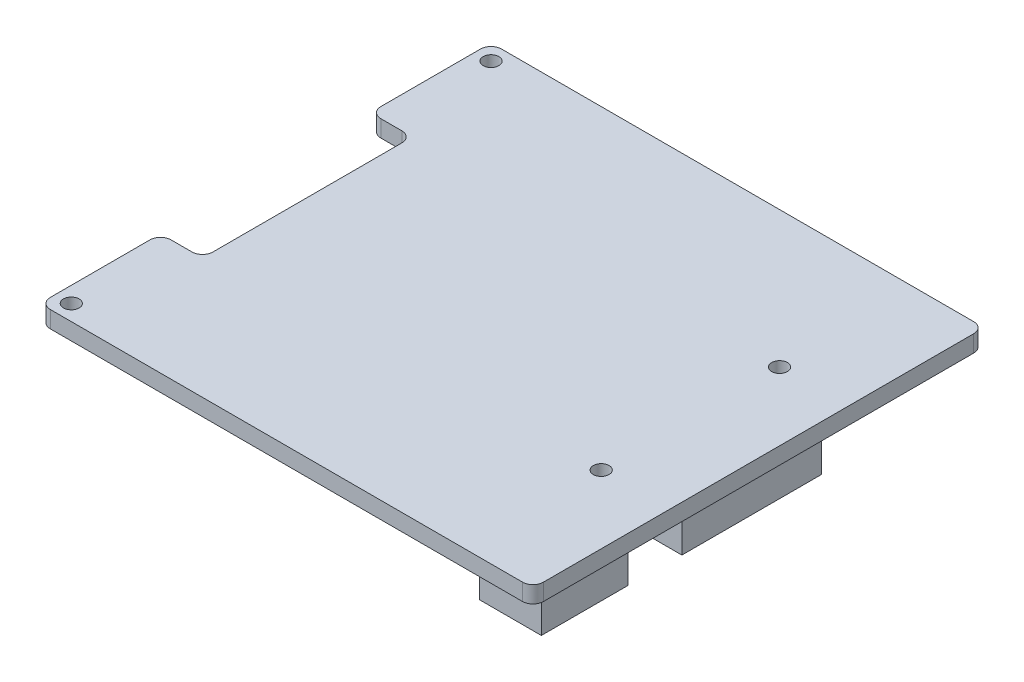
ISO-10303-21;
HEADER;
FILE_DESCRIPTION(('STEP AP214'),'2;1');
FILE_NAME('part.step','',(''),(''),'','','');
FILE_SCHEMA(('AUTOMOTIVE_DESIGN { 1 0 10303 214 1 1 1 1 }'));
ENDSEC;
DATA;
#1=APPLICATION_CONTEXT('core data for automotive mechanical design processes');
#2=APPLICATION_PROTOCOL_DEFINITION('international standard','automotive_design',2000,#1);
#3=PRODUCT_CONTEXT('',#1,'mechanical');
#4=PRODUCT('Part','Part','',(#3));
#5=PRODUCT_RELATED_PRODUCT_CATEGORY('part','',(#4));
#6=PRODUCT_DEFINITION_FORMATION('','',#4);
#7=PRODUCT_DEFINITION_CONTEXT('part definition',#1,'design');
#8=PRODUCT_DEFINITION('design','',#6,#7);
#9=PRODUCT_DEFINITION_SHAPE('','',#8);
#10=(LENGTH_UNIT() NAMED_UNIT(*) SI_UNIT(.MILLI.,.METRE.));
#11=(NAMED_UNIT(*) PLANE_ANGLE_UNIT() SI_UNIT($,.RADIAN.));
#12=(NAMED_UNIT(*) SI_UNIT($,.STERADIAN.) SOLID_ANGLE_UNIT());
#13=UNCERTAINTY_MEASURE_WITH_UNIT(LENGTH_MEASURE(1.E-05),#10,'distance_accuracy_value','');
#14=(GEOMETRIC_REPRESENTATION_CONTEXT(3) GLOBAL_UNCERTAINTY_ASSIGNED_CONTEXT((#13)) GLOBAL_UNIT_ASSIGNED_CONTEXT((#10,
#11,#12)) REPRESENTATION_CONTEXT('',''));
#15=CARTESIAN_POINT('',(0.,0.,0.));
#16=DIRECTION('',(0.,0.,1.));
#17=DIRECTION('',(1.,0.,0.));
#18=AXIS2_PLACEMENT_3D('',#15,#16,#17);
#19=CARTESIAN_POINT('',(-23.5,1.6,21.5));
#20=DIRECTION('',(1.,0.,0.));
#21=DIRECTION('',(0.,0.,-1.));
#22=AXIS2_PLACEMENT_3D('',#19,#20,#21);
#23=PLANE('',#22);
#24=DIRECTION('',(0.,0.,1.));
#25=VECTOR('',#24,1.);
#26=CARTESIAN_POINT('',(-23.5,1.6,21.5));
#27=LINE('',#26,#25);
#28=CARTESIAN_POINT('',(-23.5,1.6,11.));
#29=VERTEX_POINT('',#28);
#30=CARTESIAN_POINT('',(-23.5,1.6,20.5));
#31=VERTEX_POINT('',#30);
#32=EDGE_CURVE('E423',#29,#31,#27,.T.);
#33=ORIENTED_EDGE('',*,*,#32,.F.);
#34=DIRECTION('',(0.,-1.,0.));
#35=VECTOR('',#34,1.);
#36=CARTESIAN_POINT('',(-23.5,1.6,11.));
#37=LINE('',#36,#35);
#38=CARTESIAN_POINT('',(-23.5,0.,11.));
#39=VERTEX_POINT('',#38);
#40=EDGE_CURVE('E525',#29,#39,#37,.T.);
#41=ORIENTED_EDGE('',*,*,#40,.T.);
#42=DIRECTION('',(0.,0.,1.));
#43=VECTOR('',#42,1.);
#44=CARTESIAN_POINT('',(-23.5,0.,21.5));
#45=LINE('',#44,#43);
#46=CARTESIAN_POINT('',(-23.5,0.,20.5));
#47=VERTEX_POINT('',#46);
#48=EDGE_CURVE('E406',#39,#47,#45,.T.);
#49=ORIENTED_EDGE('',*,*,#48,.T.);
#50=DIRECTION('',(0.,-1.,0.));
#51=VECTOR('',#50,1.);
#52=CARTESIAN_POINT('',(-23.5,1.6,20.5));
#53=LINE('',#52,#51);
#54=EDGE_CURVE('E435',#47,#31,#53,.F.);
#55=ORIENTED_EDGE('',*,*,#54,.T.);
#56=EDGE_LOOP('',(#33,#41,#49,#55));
#57=FACE_BOUND('',#56,.T.);
#58=ADVANCED_FACE('F39',(#57),#23,.F.);
#59=CARTESIAN_POINT('',(-23.5,0.,-20.5));
#60=VERTEX_POINT('',#59);
#61=CARTESIAN_POINT('',(-23.5,0.,-11.));
#62=VERTEX_POINT('',#61);
#63=EDGE_CURVE('E436',#60,#62,#45,.T.);
#64=ORIENTED_EDGE('',*,*,#63,.T.);
#65=DIRECTION('',(0.,-1.,0.));
#66=VECTOR('',#65,1.);
#67=CARTESIAN_POINT('',(-23.5,1.6,-11.));
#68=LINE('',#67,#66);
#69=CARTESIAN_POINT('',(-23.5,1.6,-11.));
#70=VERTEX_POINT('',#69);
#71=EDGE_CURVE('E516',#62,#70,#68,.F.);
#72=ORIENTED_EDGE('',*,*,#71,.T.);
#73=CARTESIAN_POINT('',(-23.5,1.6,-20.5));
#74=VERTEX_POINT('',#73);
#75=EDGE_CURVE('E418',#74,#70,#27,.T.);
#76=ORIENTED_EDGE('',*,*,#75,.F.);
#77=DIRECTION('',(0.,-1.,0.));
#78=VECTOR('',#77,1.);
#79=CARTESIAN_POINT('',(-23.5,1.6,-20.5));
#80=LINE('',#79,#78);
#81=EDGE_CURVE('E455',#74,#60,#80,.T.);
#82=ORIENTED_EDGE('',*,*,#81,.T.);
#83=EDGE_LOOP('',(#64,#72,#76,#82));
#84=FACE_BOUND('',#83,.T.);
#85=ADVANCED_FACE('F625',(#84),#23,.F.);
#86=CARTESIAN_POINT('',(23.5,1.6,21.5));
#87=DIRECTION('',(0.,0.,-1.));
#88=DIRECTION('',(-1.,0.,0.));
#89=AXIS2_PLACEMENT_3D('',#86,#87,#88);
#90=PLANE('',#89);
#91=DIRECTION('',(1.,0.,0.));
#92=VECTOR('',#91,1.);
#93=CARTESIAN_POINT('',(23.5,0.,21.5));
#94=LINE('',#93,#92);
#95=CARTESIAN_POINT('',(-22.5,0.,21.5));
#96=VERTEX_POINT('',#95);
#97=CARTESIAN_POINT('',(22.5,0.,21.5));
#98=VERTEX_POINT('',#97);
#99=EDGE_CURVE('E440',#96,#98,#94,.T.);
#100=ORIENTED_EDGE('',*,*,#99,.T.);
#101=DIRECTION('',(0.,-1.,0.));
#102=VECTOR('',#101,1.);
#103=CARTESIAN_POINT('',(22.5,1.6,21.5));
#104=LINE('',#103,#102);
#105=CARTESIAN_POINT('',(22.5,1.6,21.5));
#106=VERTEX_POINT('',#105);
#107=EDGE_CURVE('E502',#98,#106,#104,.F.);
#108=ORIENTED_EDGE('',*,*,#107,.T.);
#109=DIRECTION('',(1.,0.,0.));
#110=VECTOR('',#109,1.);
#111=CARTESIAN_POINT('',(23.5,1.6,21.5));
#112=LINE('',#111,#110);
#113=CARTESIAN_POINT('',(-22.5,1.6,21.5));
#114=VERTEX_POINT('',#113);
#115=EDGE_CURVE('E422',#114,#106,#112,.T.);
#116=ORIENTED_EDGE('',*,*,#115,.F.);
#117=DIRECTION('',(0.,-1.,0.));
#118=VECTOR('',#117,1.);
#119=CARTESIAN_POINT('',(-22.5,1.6,21.5));
#120=LINE('',#119,#118);
#121=EDGE_CURVE('E498',#114,#96,#120,.T.);
#122=ORIENTED_EDGE('',*,*,#121,.T.);
#123=EDGE_LOOP('',(#100,#108,#116,#122));
#124=FACE_BOUND('',#123,.T.);
#125=ADVANCED_FACE('F599',(#124),#90,.F.);
#126=CARTESIAN_POINT('',(23.5,1.6,21.5));
#127=DIRECTION('',(-1.,0.,0.));
#128=DIRECTION('',(0.,0.,1.));
#129=AXIS2_PLACEMENT_3D('',#126,#127,#128);
#130=PLANE('',#129);
#131=DIRECTION('',(0.,0.,-1.));
#132=VECTOR('',#131,1.);
#133=CARTESIAN_POINT('',(23.5,0.,21.5));
#134=LINE('',#133,#132);
#135=CARTESIAN_POINT('',(23.5,0.,20.5));
#136=VERTEX_POINT('',#135);
#137=CARTESIAN_POINT('',(23.5,0.,-20.5));
#138=VERTEX_POINT('',#137);
#139=EDGE_CURVE('E444',#136,#138,#134,.T.);
#140=ORIENTED_EDGE('',*,*,#139,.T.);
#141=DIRECTION('',(0.,-1.,0.));
#142=VECTOR('',#141,1.);
#143=CARTESIAN_POINT('',(23.5,1.6,-20.5));
#144=LINE('',#143,#142);
#145=CARTESIAN_POINT('',(23.5,1.6,-20.5));
#146=VERTEX_POINT('',#145);
#147=EDGE_CURVE('E495',#138,#146,#144,.F.);
#148=ORIENTED_EDGE('',*,*,#147,.T.);
#149=DIRECTION('',(0.,0.,-1.));
#150=VECTOR('',#149,1.);
#151=CARTESIAN_POINT('',(23.5,1.6,21.5));
#152=LINE('',#151,#150);
#153=CARTESIAN_POINT('',(23.5,1.6,20.5));
#154=VERTEX_POINT('',#153);
#155=EDGE_CURVE('E427',#154,#146,#152,.T.);
#156=ORIENTED_EDGE('',*,*,#155,.F.);
#157=DIRECTION('',(0.,-1.,0.));
#158=VECTOR('',#157,1.);
#159=CARTESIAN_POINT('',(23.5,1.6,20.5));
#160=LINE('',#159,#158);
#161=EDGE_CURVE('E491',#154,#136,#160,.T.);
#162=ORIENTED_EDGE('',*,*,#161,.T.);
#163=EDGE_LOOP('',(#140,#148,#156,#162));
#164=FACE_BOUND('',#163,.T.);
#165=ADVANCED_FACE('F607',(#164),#130,.F.);
#166=CARTESIAN_POINT('',(23.5,1.6,-21.5));
#167=DIRECTION('',(0.,0.,1.));
#168=DIRECTION('',(1.,0.,0.));
#169=AXIS2_PLACEMENT_3D('',#166,#167,#168);
#170=PLANE('',#169);
#171=DIRECTION('',(-1.,0.,0.));
#172=VECTOR('',#171,1.);
#173=CARTESIAN_POINT('',(23.5,0.,-21.5));
#174=LINE('',#173,#172);
#175=CARTESIAN_POINT('',(22.5,0.,-21.5));
#176=VERTEX_POINT('',#175);
#177=CARTESIAN_POINT('',(-22.5,0.,-21.5));
#178=VERTEX_POINT('',#177);
#179=EDGE_CURVE('E448',#176,#178,#174,.T.);
#180=ORIENTED_EDGE('',*,*,#179,.T.);
#181=DIRECTION('',(0.,-1.,0.));
#182=VECTOR('',#181,1.);
#183=CARTESIAN_POINT('',(-22.5,1.6,-21.5));
#184=LINE('',#183,#182);
#185=CARTESIAN_POINT('',(-22.5,1.6,-21.5));
#186=VERTEX_POINT('',#185);
#187=EDGE_CURVE('E476',#178,#186,#184,.F.);
#188=ORIENTED_EDGE('',*,*,#187,.T.);
#189=DIRECTION('',(-1.,0.,0.));
#190=VECTOR('',#189,1.);
#191=CARTESIAN_POINT('',(23.5,1.6,-21.5));
#192=LINE('',#191,#190);
#193=CARTESIAN_POINT('',(22.5,1.6,-21.5));
#194=VERTEX_POINT('',#193);
#195=EDGE_CURVE('E431',#194,#186,#192,.T.);
#196=ORIENTED_EDGE('',*,*,#195,.F.);
#197=DIRECTION('',(0.,-1.,0.));
#198=VECTOR('',#197,1.);
#199=CARTESIAN_POINT('',(22.5,1.6,-21.5));
#200=LINE('',#199,#198);
#201=EDGE_CURVE('E472',#194,#176,#200,.T.);
#202=ORIENTED_EDGE('',*,*,#201,.T.);
#203=EDGE_LOOP('',(#180,#188,#196,#202));
#204=FACE_BOUND('',#203,.T.);
#205=ADVANCED_FACE('F616',(#204),#170,.F.);
#206=CARTESIAN_POINT('',(0.,1.6,0.));
#207=DIRECTION('',(0.,1.,0.));
#208=DIRECTION('',(0.,0.,1.));
#209=AXIS2_PLACEMENT_3D('',#206,#207,#208);
#210=PLANE('',#209);
#211=ORIENTED_EDGE('',*,*,#75,.T.);
#212=CARTESIAN_POINT('',(-22.5,1.6,-11.));
#213=DIRECTION('',(0.,1.,0.));
#214=DIRECTION('',(0.,0.,1.));
#215=AXIS2_PLACEMENT_3D('',#212,#213,#214);
#216=CIRCLE('',#215,1.);
#217=CARTESIAN_POINT('',(-22.5,1.6,-10.));
#218=VERTEX_POINT('',#217);
#219=EDGE_CURVE('E522',#70,#218,#216,.T.);
#220=ORIENTED_EDGE('',*,*,#219,.T.);
#221=DIRECTION('',(1.,0.,0.));
#222=VECTOR('',#221,1.);
#223=CARTESIAN_POINT('',(-19.5,1.6,-10.));
#224=LINE('',#223,#222);
#225=CARTESIAN_POINT('',(-20.5,1.6,-10.));
#226=VERTEX_POINT('',#225);
#227=EDGE_CURVE('E364',#218,#226,#224,.T.);
#228=ORIENTED_EDGE('',*,*,#227,.T.);
#229=CARTESIAN_POINT('',(-20.5,1.6,-9.));
#230=DIRECTION('',(0.,1.,0.));
#231=DIRECTION('',(0.,0.,1.));
#232=AXIS2_PLACEMENT_3D('',#229,#230,#231);
#233=CIRCLE('',#232,1.);
#234=CARTESIAN_POINT('',(-19.5,1.6,-9.));
#235=VERTEX_POINT('',#234);
#236=EDGE_CURVE('E11',#226,#235,#233,.F.);
#237=ORIENTED_EDGE('',*,*,#236,.T.);
#238=DIRECTION('',(0.,0.,1.));
#239=VECTOR('',#238,1.);
#240=CARTESIAN_POINT('',(-19.5,1.6,-10.));
#241=LINE('',#240,#239);
#242=CARTESIAN_POINT('',(-19.5,1.6,9.));
#243=VERTEX_POINT('',#242);
#244=EDGE_CURVE('E368',#235,#243,#241,.T.);
#245=ORIENTED_EDGE('',*,*,#244,.T.);
#246=CARTESIAN_POINT('',(-20.5,1.6,9.));
#247=DIRECTION('',(0.,1.,0.));
#248=DIRECTION('',(0.,0.,1.));
#249=AXIS2_PLACEMENT_3D('',#246,#247,#248);
#250=CIRCLE('',#249,1.);
#251=CARTESIAN_POINT('',(-20.5,1.6,10.));
#252=VERTEX_POINT('',#251);
#253=EDGE_CURVE('E550',#243,#252,#250,.F.);
#254=ORIENTED_EDGE('',*,*,#253,.T.);
#255=DIRECTION('',(-1.,0.,0.));
#256=VECTOR('',#255,1.);
#257=CARTESIAN_POINT('',(-19.5,1.6,10.));
#258=LINE('',#257,#256);
#259=CARTESIAN_POINT('',(-22.5,1.6,10.));
#260=VERTEX_POINT('',#259);
#261=EDGE_CURVE('E373',#252,#260,#258,.T.);
#262=ORIENTED_EDGE('',*,*,#261,.T.);
#263=CARTESIAN_POINT('',(-22.5,1.6,11.));
#264=DIRECTION('',(0.,1.,0.));
#265=DIRECTION('',(0.,0.,1.));
#266=AXIS2_PLACEMENT_3D('',#263,#264,#265);
#267=CIRCLE('',#266,1.);
#268=EDGE_CURVE('E519',#260,#29,#267,.T.);
#269=ORIENTED_EDGE('',*,*,#268,.T.);
#270=ORIENTED_EDGE('',*,*,#32,.T.);
#271=CARTESIAN_POINT('',(-22.5,1.6,20.5));
#272=DIRECTION('',(0.,1.,0.));
#273=DIRECTION('',(0.,0.,1.));
#274=AXIS2_PLACEMENT_3D('',#271,#272,#273);
#275=CIRCLE('',#274,1.);
#276=EDGE_CURVE('E479',#31,#114,#275,.T.);
#277=ORIENTED_EDGE('',*,*,#276,.T.);
#278=ORIENTED_EDGE('',*,*,#115,.T.);
#279=CARTESIAN_POINT('',(22.5,1.6,20.5));
#280=DIRECTION('',(0.,1.,0.));
#281=DIRECTION('',(0.,0.,1.));
#282=AXIS2_PLACEMENT_3D('',#279,#280,#281);
#283=CIRCLE('',#282,1.);
#284=EDGE_CURVE('E482',#106,#154,#283,.T.);
#285=ORIENTED_EDGE('',*,*,#284,.T.);
#286=ORIENTED_EDGE('',*,*,#155,.T.);
#287=CARTESIAN_POINT('',(22.5,1.6,-20.5));
#288=DIRECTION('',(0.,1.,0.));
#289=DIRECTION('',(0.,0.,1.));
#290=AXIS2_PLACEMENT_3D('',#287,#288,#289);
#291=CIRCLE('',#290,1.);
#292=EDGE_CURVE('E485',#146,#194,#291,.T.);
#293=ORIENTED_EDGE('',*,*,#292,.T.);
#294=ORIENTED_EDGE('',*,*,#195,.T.);
#295=CARTESIAN_POINT('',(-22.5,1.6,-20.5));
#296=DIRECTION('',(0.,1.,0.));
#297=DIRECTION('',(0.,0.,1.));
#298=AXIS2_PLACEMENT_3D('',#295,#296,#297);
#299=CIRCLE('',#298,1.);
#300=EDGE_CURVE('E488',#186,#74,#299,.T.);
#301=ORIENTED_EDGE('',*,*,#300,.T.);
#302=EDGE_LOOP('',(#211,#220,#228,#237,#245,#254,#262,#269,#270,#277,#278,#285,#286,#293,#294,#301));
#303=FACE_BOUND('',#302,.T.);
#304=CARTESIAN_POINT('',(17.,1.6,-8.5));
#305=DIRECTION('',(0.,1.,0.));
#306=DIRECTION('',(0.,0.,1.));
#307=AXIS2_PLACEMENT_3D('',#304,#305,#306);
#308=CIRCLE('',#307,0.750000000000002);
#309=CARTESIAN_POINT('',(17.,1.6,-7.75));
#310=VERTEX_POINT('',#309);
#311=EDGE_CURVE('E391',#310,#310,#308,.T.);
#312=ORIENTED_EDGE('',*,*,#311,.F.);
#313=EDGE_LOOP('',(#312));
#314=FACE_BOUND('',#313,.T.);
#315=CARTESIAN_POINT('',(17.,1.6,8.5));
#316=DIRECTION('',(0.,1.,0.));
#317=DIRECTION('',(0.,0.,-1.));
#318=AXIS2_PLACEMENT_3D('',#315,#316,#317);
#319=CIRCLE('',#318,0.750000000000002);
#320=CARTESIAN_POINT('',(17.,1.6,7.75));
#321=VERTEX_POINT('',#320);
#322=EDGE_CURVE('E376',#321,#321,#319,.T.);
#323=ORIENTED_EDGE('',*,*,#322,.F.);
#324=EDGE_LOOP('',(#323));
#325=FACE_BOUND('',#324,.T.);
#326=CARTESIAN_POINT('',(-22.,1.6,-20.));
#327=DIRECTION('',(0.,1.,0.));
#328=DIRECTION('',(0.,0.,1.));
#329=AXIS2_PLACEMENT_3D('',#326,#327,#328);
#330=CIRCLE('',#329,0.750000000000002);
#331=CARTESIAN_POINT('',(-22.,1.6,-19.25));
#332=VERTEX_POINT('',#331);
#333=EDGE_CURVE('E407',#332,#332,#330,.T.);
#334=ORIENTED_EDGE('',*,*,#333,.F.);
#335=EDGE_LOOP('',(#334));
#336=FACE_BOUND('',#335,.T.);
#337=CARTESIAN_POINT('',(-22.,1.6,20.));
#338=DIRECTION('',(0.,1.,0.));
#339=DIRECTION('',(0.,0.,-1.));
#340=AXIS2_PLACEMENT_3D('',#337,#338,#339);
#341=CIRCLE('',#340,0.750000000000002);
#342=CARTESIAN_POINT('',(-22.,1.6,19.25));
#343=VERTEX_POINT('',#342);
#344=EDGE_CURVE('E390',#343,#343,#341,.T.);
#345=ORIENTED_EDGE('',*,*,#344,.F.);
#346=EDGE_LOOP('',(#345));
#347=FACE_BOUND('',#346,.T.);
#348=ADVANCED_FACE('F567',(#303,#314,#325,#336,#347),#210,.T.);
#349=CARTESIAN_POINT('',(0.,0.,0.));
#350=DIRECTION('',(0.,1.,0.));
#351=DIRECTION('',(0.,0.,1.));
#352=AXIS2_PLACEMENT_3D('',#349,#350,#351);
#353=PLANE('',#352);
#354=DIRECTION('',(-1.,0.,0.));
#355=VECTOR('',#354,1.);
#356=CARTESIAN_POINT('',(23.2049778786149,0.,12.1685105076031));
#357=LINE('',#356,#355);
#358=CARTESIAN_POINT('',(23.2049778786149,0.,12.1685105076031));
#359=VERTEX_POINT('',#358);
#360=CARTESIAN_POINT('',(17.3281707424951,0.,12.1685105076031));
#361=VERTEX_POINT('',#360);
#362=EDGE_CURVE('E252',#359,#361,#357,.T.);
#363=ORIENTED_EDGE('',*,*,#362,.T.);
#364=DIRECTION('',(0.,0.,1.));
#365=VECTOR('',#364,1.);
#366=CARTESIAN_POINT('',(17.3281707424951,0.,12.1685105076031));
#367=LINE('',#366,#365);
#368=CARTESIAN_POINT('',(17.3281707424951,0.,20.4068834194198));
#369=VERTEX_POINT('',#368);
#370=EDGE_CURVE('E262',#361,#369,#367,.T.);
#371=ORIENTED_EDGE('',*,*,#370,.T.);
#372=DIRECTION('',(1.,0.,0.));
#373=VECTOR('',#372,1.);
#374=CARTESIAN_POINT('',(23.2049778786149,0.,20.4068834194198));
#375=LINE('',#374,#373);
#376=CARTESIAN_POINT('',(23.2049778786149,0.,20.4068834194198));
#377=VERTEX_POINT('',#376);
#378=EDGE_CURVE('E229',#369,#377,#375,.T.);
#379=ORIENTED_EDGE('',*,*,#378,.T.);
#380=DIRECTION('',(0.,0.,-1.));
#381=VECTOR('',#380,1.);
#382=CARTESIAN_POINT('',(23.2049778786149,0.,12.1685105076031));
#383=LINE('',#382,#381);
#384=EDGE_CURVE('E55',#377,#359,#383,.T.);
#385=ORIENTED_EDGE('',*,*,#384,.T.);
#386=EDGE_LOOP('',(#363,#371,#379,#385));
#387=FACE_BOUND('',#386,.T.);
#388=DIRECTION('',(-1.,0.,0.));
#389=VECTOR('',#388,1.);
#390=CARTESIAN_POINT('',(23.2653723881634,0.,-6.25083173827741));
#391=LINE('',#390,#389);
#392=CARTESIAN_POINT('',(23.2653723881634,0.,-6.25083173827741));
#393=VERTEX_POINT('',#392);
#394=CARTESIAN_POINT('',(17.3281707424951,0.,-6.25083173827741));
#395=VERTEX_POINT('',#394);
#396=EDGE_CURVE('E282',#393,#395,#391,.T.);
#397=ORIENTED_EDGE('',*,*,#396,.T.);
#398=DIRECTION('',(0.,0.,1.));
#399=VECTOR('',#398,1.);
#400=CARTESIAN_POINT('',(17.3281707424951,0.,-6.25083173827741));
#401=LINE('',#400,#399);
#402=CARTESIAN_POINT('',(17.3281707424951,0.,7.07535794260706));
#403=VERTEX_POINT('',#402);
#404=EDGE_CURVE('E271',#395,#403,#401,.T.);
#405=ORIENTED_EDGE('',*,*,#404,.T.);
#406=DIRECTION('',(1.,0.,0.));
#407=VECTOR('',#406,1.);
#408=CARTESIAN_POINT('',(23.2653723881634,0.,7.07535794260706));
#409=LINE('',#408,#407);
#410=CARTESIAN_POINT('',(23.2653723881634,0.,7.07535794260706));
#411=VERTEX_POINT('',#410);
#412=EDGE_CURVE('E298',#403,#411,#409,.T.);
#413=ORIENTED_EDGE('',*,*,#412,.T.);
#414=DIRECTION('',(0.,0.,-1.));
#415=VECTOR('',#414,1.);
#416=CARTESIAN_POINT('',(23.2653723881634,0.,-6.25083173827741));
#417=LINE('',#416,#415);
#418=EDGE_CURVE('E63',#411,#393,#417,.T.);
#419=ORIENTED_EDGE('',*,*,#418,.T.);
#420=EDGE_LOOP('',(#397,#405,#413,#419));
#421=FACE_BOUND('',#420,.T.);
#422=DIRECTION('',(-1.,0.,0.));
#423=VECTOR('',#422,1.);
#424=CARTESIAN_POINT('',(-12.0010913090405,0.,-17.1104668168499));
#425=LINE('',#424,#423);
#426=CARTESIAN_POINT('',(-12.0010913090405,0.,-17.1104668168499));
#427=VERTEX_POINT('',#426);
#428=CARTESIAN_POINT('',(-17.0708592547743,0.,-17.1104668168499));
#429=VERTEX_POINT('',#428);
#430=EDGE_CURVE('E324',#427,#429,#425,.T.);
#431=ORIENTED_EDGE('',*,*,#430,.T.);
#432=DIRECTION('',(0.,0.,1.));
#433=VECTOR('',#432,1.);
#434=CARTESIAN_POINT('',(-17.0708592547743,0.,-17.1104668168499));
#435=LINE('',#434,#433);
#436=CARTESIAN_POINT('',(-17.0708592547743,0.,17.1104668168499));
#437=VERTEX_POINT('',#436);
#438=EDGE_CURVE('E310',#429,#437,#435,.T.);
#439=ORIENTED_EDGE('',*,*,#438,.T.);
#440=DIRECTION('',(1.,0.,0.));
#441=VECTOR('',#440,1.);
#442=CARTESIAN_POINT('',(-12.0010913090405,0.,17.1104668168499));
#443=LINE('',#442,#441);
#444=CARTESIAN_POINT('',(-12.0010913090405,0.,17.1104668168499));
#445=VERTEX_POINT('',#444);
#446=EDGE_CURVE('E340',#437,#445,#443,.T.);
#447=ORIENTED_EDGE('',*,*,#446,.T.);
#448=DIRECTION('',(0.,0.,-1.));
#449=VECTOR('',#448,1.);
#450=CARTESIAN_POINT('',(-12.0010913090405,0.,-17.1104668168499));
#451=LINE('',#450,#449);
#452=EDGE_CURVE('E344',#445,#427,#451,.T.);
#453=ORIENTED_EDGE('',*,*,#452,.T.);
#454=EDGE_LOOP('',(#431,#439,#447,#453));
#455=FACE_BOUND('',#454,.T.);
#456=CARTESIAN_POINT('',(17.,0.,-8.5));
#457=DIRECTION('',(0.,1.,0.));
#458=DIRECTION('',(0.,0.,1.));
#459=AXIS2_PLACEMENT_3D('',#456,#457,#458);
#460=CIRCLE('',#459,0.750000000000002);
#461=CARTESIAN_POINT('',(17.,0.,-7.75));
#462=VERTEX_POINT('',#461);
#463=EDGE_CURVE('E386',#462,#462,#460,.T.);
#464=ORIENTED_EDGE('',*,*,#463,.T.);
#465=EDGE_LOOP('',(#464));
#466=FACE_BOUND('',#465,.T.);
#467=CARTESIAN_POINT('',(17.,0.,8.5));
#468=DIRECTION('',(0.,1.,0.));
#469=DIRECTION('',(0.,0.,-1.));
#470=AXIS2_PLACEMENT_3D('',#467,#468,#469);
#471=CIRCLE('',#470,0.750000000000002);
#472=CARTESIAN_POINT('',(17.,0.,7.75));
#473=VERTEX_POINT('',#472);
#474=EDGE_CURVE('E395',#473,#473,#471,.T.);
#475=ORIENTED_EDGE('',*,*,#474,.T.);
#476=EDGE_LOOP('',(#475));
#477=FACE_BOUND('',#476,.T.);
#478=CARTESIAN_POINT('',(-22.,0.,-20.));
#479=DIRECTION('',(0.,1.,0.));
#480=DIRECTION('',(0.,0.,1.));
#481=AXIS2_PLACEMENT_3D('',#478,#479,#480);
#482=CIRCLE('',#481,0.750000000000002);
#483=CARTESIAN_POINT('',(-22.,0.,-19.25));
#484=VERTEX_POINT('',#483);
#485=EDGE_CURVE('E402',#484,#484,#482,.T.);
#486=ORIENTED_EDGE('',*,*,#485,.T.);
#487=EDGE_LOOP('',(#486));
#488=FACE_BOUND('',#487,.T.);
#489=CARTESIAN_POINT('',(-22.,0.,20.));
#490=DIRECTION('',(0.,1.,0.));
#491=DIRECTION('',(0.,0.,-1.));
#492=AXIS2_PLACEMENT_3D('',#489,#490,#491);
#493=CIRCLE('',#492,0.750000000000002);
#494=CARTESIAN_POINT('',(-22.,0.,19.25));
#495=VERTEX_POINT('',#494);
#496=EDGE_CURVE('E411',#495,#495,#493,.T.);
#497=ORIENTED_EDGE('',*,*,#496,.T.);
#498=EDGE_LOOP('',(#497));
#499=FACE_BOUND('',#498,.T.);
#500=DIRECTION('',(1.,0.,0.));
#501=VECTOR('',#500,1.);
#502=CARTESIAN_POINT('',(-19.5,0.,-10.));
#503=LINE('',#502,#501);
#504=CARTESIAN_POINT('',(-22.5,0.,-10.));
#505=VERTEX_POINT('',#504);
#506=CARTESIAN_POINT('',(-20.5,0.,-10.));
#507=VERTEX_POINT('',#506);
#508=EDGE_CURVE('E354',#505,#507,#503,.T.);
#509=ORIENTED_EDGE('',*,*,#508,.F.);
#510=CARTESIAN_POINT('',(-22.5,0.,-11.));
#511=DIRECTION('',(0.,1.,0.));
#512=DIRECTION('',(0.,0.,1.));
#513=AXIS2_PLACEMENT_3D('',#510,#511,#512);
#514=CIRCLE('',#513,1.);
#515=EDGE_CURVE('E513',#505,#62,#514,.F.);
#516=ORIENTED_EDGE('',*,*,#515,.T.);
#517=ORIENTED_EDGE('',*,*,#63,.F.);
#518=CARTESIAN_POINT('',(-22.5,0.,-20.5));
#519=DIRECTION('',(0.,1.,0.));
#520=DIRECTION('',(0.,0.,1.));
#521=AXIS2_PLACEMENT_3D('',#518,#519,#520);
#522=CIRCLE('',#521,1.);
#523=EDGE_CURVE('E469',#60,#178,#522,.F.);
#524=ORIENTED_EDGE('',*,*,#523,.T.);
#525=ORIENTED_EDGE('',*,*,#179,.F.);
#526=CARTESIAN_POINT('',(22.5,0.,-20.5));
#527=DIRECTION('',(0.,1.,0.));
#528=DIRECTION('',(0.,0.,1.));
#529=AXIS2_PLACEMENT_3D('',#526,#527,#528);
#530=CIRCLE('',#529,1.);
#531=EDGE_CURVE('E466',#176,#138,#530,.F.);
#532=ORIENTED_EDGE('',*,*,#531,.T.);
#533=ORIENTED_EDGE('',*,*,#139,.F.);
#534=CARTESIAN_POINT('',(22.5,0.,20.5));
#535=DIRECTION('',(0.,1.,0.));
#536=DIRECTION('',(0.,0.,1.));
#537=AXIS2_PLACEMENT_3D('',#534,#535,#536);
#538=CIRCLE('',#537,1.);
#539=EDGE_CURVE('E463',#136,#98,#538,.F.);
#540=ORIENTED_EDGE('',*,*,#539,.T.);
#541=ORIENTED_EDGE('',*,*,#99,.F.);
#542=CARTESIAN_POINT('',(-22.5,0.,20.5));
#543=DIRECTION('',(0.,1.,0.));
#544=DIRECTION('',(0.,0.,1.));
#545=AXIS2_PLACEMENT_3D('',#542,#543,#544);
#546=CIRCLE('',#545,1.);
#547=EDGE_CURVE('E459',#96,#47,#546,.F.);
#548=ORIENTED_EDGE('',*,*,#547,.T.);
#549=ORIENTED_EDGE('',*,*,#48,.F.);
#550=CARTESIAN_POINT('',(-22.5,0.,11.));
#551=DIRECTION('',(0.,1.,0.));
#552=DIRECTION('',(0.,0.,1.));
#553=AXIS2_PLACEMENT_3D('',#550,#551,#552);
#554=CIRCLE('',#553,1.);
#555=CARTESIAN_POINT('',(-22.5,0.,10.));
#556=VERTEX_POINT('',#555);
#557=EDGE_CURVE('E509',#39,#556,#554,.F.);
#558=ORIENTED_EDGE('',*,*,#557,.T.);
#559=DIRECTION('',(-1.,0.,0.));
#560=VECTOR('',#559,1.);
#561=CARTESIAN_POINT('',(-19.5,0.,10.));
#562=LINE('',#561,#560);
#563=CARTESIAN_POINT('',(-20.5,0.,10.));
#564=VERTEX_POINT('',#563);
#565=EDGE_CURVE('E369',#564,#556,#562,.T.);
#566=ORIENTED_EDGE('',*,*,#565,.F.);
#567=CARTESIAN_POINT('',(-20.5,0.,9.));
#568=DIRECTION('',(0.,1.,0.));
#569=DIRECTION('',(0.,0.,1.));
#570=AXIS2_PLACEMENT_3D('',#567,#568,#569);
#571=CIRCLE('',#570,1.);
#572=CARTESIAN_POINT('',(-19.5,0.,9.));
#573=VERTEX_POINT('',#572);
#574=EDGE_CURVE('E547',#564,#573,#571,.T.);
#575=ORIENTED_EDGE('',*,*,#574,.T.);
#576=DIRECTION('',(0.,0.,1.));
#577=VECTOR('',#576,1.);
#578=CARTESIAN_POINT('',(-19.5,0.,-10.));
#579=LINE('',#578,#577);
#580=CARTESIAN_POINT('',(-19.5,0.,-9.));
#581=VERTEX_POINT('',#580);
#582=EDGE_CURVE('E380',#581,#573,#579,.T.);
#583=ORIENTED_EDGE('',*,*,#582,.F.);
#584=CARTESIAN_POINT('',(-20.5,0.,-9.));
#585=DIRECTION('',(0.,1.,0.));
#586=DIRECTION('',(0.,0.,1.));
#587=AXIS2_PLACEMENT_3D('',#584,#585,#586);
#588=CIRCLE('',#587,1.);
#589=EDGE_CURVE('E48',#581,#507,#588,.T.);
#590=ORIENTED_EDGE('',*,*,#589,.T.);
#591=EDGE_LOOP('',(#509,#516,#517,#524,#525,#532,#533,#540,#541,#548,#549,#558,#566,#575,#583,#590));
#592=FACE_BOUND('',#591,.T.);
#593=ADVANCED_FACE('F556',(#387,#421,#455,#466,#477,#488,#499,#592),#353,.F.);
#594=CARTESIAN_POINT('',(-22.,0.,20.));
#595=DIRECTION('',(0.,1.,0.));
#596=DIRECTION('',(0.,0.,1.));
#597=AXIS2_PLACEMENT_3D('',#594,#595,#596);
#598=CYLINDRICAL_SURFACE('',#597,0.750000000000002);
#599=ORIENTED_EDGE('',*,*,#496,.F.);
#600=EDGE_LOOP('',(#599));
#601=FACE_BOUND('',#600,.T.);
#602=ORIENTED_EDGE('',*,*,#344,.T.);
#603=EDGE_LOOP('',(#602));
#604=FACE_BOUND('',#603,.T.);
#605=ADVANCED_FACE('F676',(#601,#604),#598,.F.);
#606=CARTESIAN_POINT('',(-22.,0.,-20.));
#607=DIRECTION('',(0.,1.,0.));
#608=DIRECTION('',(0.,0.,1.));
#609=AXIS2_PLACEMENT_3D('',#606,#607,#608);
#610=CYLINDRICAL_SURFACE('',#609,0.750000000000002);
#611=ORIENTED_EDGE('',*,*,#485,.F.);
#612=EDGE_LOOP('',(#611));
#613=FACE_BOUND('',#612,.T.);
#614=ORIENTED_EDGE('',*,*,#333,.T.);
#615=EDGE_LOOP('',(#614));
#616=FACE_BOUND('',#615,.T.);
#617=ADVANCED_FACE('F672',(#613,#616),#610,.F.);
#618=CARTESIAN_POINT('',(17.,0.,8.5));
#619=DIRECTION('',(0.,1.,0.));
#620=DIRECTION('',(0.,0.,1.));
#621=AXIS2_PLACEMENT_3D('',#618,#619,#620);
#622=CYLINDRICAL_SURFACE('',#621,0.750000000000002);
#623=ORIENTED_EDGE('',*,*,#474,.F.);
#624=EDGE_LOOP('',(#623));
#625=FACE_BOUND('',#624,.T.);
#626=ORIENTED_EDGE('',*,*,#322,.T.);
#627=EDGE_LOOP('',(#626));
#628=FACE_BOUND('',#627,.T.);
#629=ADVANCED_FACE('F668',(#625,#628),#622,.F.);
#630=CARTESIAN_POINT('',(17.,0.,-8.5));
#631=DIRECTION('',(0.,1.,0.));
#632=DIRECTION('',(0.,0.,1.));
#633=AXIS2_PLACEMENT_3D('',#630,#631,#632);
#634=CYLINDRICAL_SURFACE('',#633,0.750000000000002);
#635=ORIENTED_EDGE('',*,*,#463,.F.);
#636=EDGE_LOOP('',(#635));
#637=FACE_BOUND('',#636,.T.);
#638=ORIENTED_EDGE('',*,*,#311,.T.);
#639=EDGE_LOOP('',(#638));
#640=FACE_BOUND('',#639,.T.);
#641=ADVANCED_FACE('F649',(#637,#640),#634,.F.);
#642=CARTESIAN_POINT('',(-22.5,1.6,-20.5));
#643=DIRECTION('',(0.,-1.,0.));
#644=DIRECTION('',(0.,0.,-1.));
#645=AXIS2_PLACEMENT_3D('',#642,#643,#644);
#646=CYLINDRICAL_SURFACE('',#645,1.);
#647=ORIENTED_EDGE('',*,*,#300,.F.);
#648=ORIENTED_EDGE('',*,*,#187,.F.);
#649=ORIENTED_EDGE('',*,*,#523,.F.);
#650=ORIENTED_EDGE('',*,*,#81,.F.);
#651=EDGE_LOOP('',(#647,#648,#649,#650));
#652=FACE_BOUND('',#651,.T.);
#653=ADVANCED_FACE('F620',(#652),#646,.T.);
#654=CARTESIAN_POINT('',(22.5,1.6,-20.5));
#655=DIRECTION('',(0.,-1.,0.));
#656=DIRECTION('',(0.,0.,-1.));
#657=AXIS2_PLACEMENT_3D('',#654,#655,#656);
#658=CYLINDRICAL_SURFACE('',#657,1.);
#659=ORIENTED_EDGE('',*,*,#292,.F.);
#660=ORIENTED_EDGE('',*,*,#147,.F.);
#661=ORIENTED_EDGE('',*,*,#531,.F.);
#662=ORIENTED_EDGE('',*,*,#201,.F.);
#663=EDGE_LOOP('',(#659,#660,#661,#662));
#664=FACE_BOUND('',#663,.T.);
#665=ADVANCED_FACE('F611',(#664),#658,.T.);
#666=CARTESIAN_POINT('',(22.5,1.6,20.5));
#667=DIRECTION('',(0.,-1.,0.));
#668=DIRECTION('',(0.,0.,-1.));
#669=AXIS2_PLACEMENT_3D('',#666,#667,#668);
#670=CYLINDRICAL_SURFACE('',#669,1.);
#671=ORIENTED_EDGE('',*,*,#284,.F.);
#672=ORIENTED_EDGE('',*,*,#107,.F.);
#673=ORIENTED_EDGE('',*,*,#539,.F.);
#674=ORIENTED_EDGE('',*,*,#161,.F.);
#675=EDGE_LOOP('',(#671,#672,#673,#674));
#676=FACE_BOUND('',#675,.T.);
#677=ADVANCED_FACE('F602',(#676),#670,.T.);
#678=CARTESIAN_POINT('',(-22.5,1.6,20.5));
#679=DIRECTION('',(0.,-1.,0.));
#680=DIRECTION('',(0.,0.,-1.));
#681=AXIS2_PLACEMENT_3D('',#678,#679,#680);
#682=CYLINDRICAL_SURFACE('',#681,1.);
#683=ORIENTED_EDGE('',*,*,#276,.F.);
#684=ORIENTED_EDGE('',*,*,#54,.F.);
#685=ORIENTED_EDGE('',*,*,#547,.F.);
#686=ORIENTED_EDGE('',*,*,#121,.F.);
#687=EDGE_LOOP('',(#683,#684,#685,#686));
#688=FACE_BOUND('',#687,.T.);
#689=ADVANCED_FACE('F595',(#688),#682,.T.);
#690=CARTESIAN_POINT('',(-19.5,1.6,10.));
#691=DIRECTION('',(0.,0.,1.));
#692=DIRECTION('',(1.,0.,0.));
#693=AXIS2_PLACEMENT_3D('',#690,#691,#692);
#694=PLANE('',#693);
#695=ORIENTED_EDGE('',*,*,#261,.F.);
#696=DIRECTION('',(0.,-1.,0.));
#697=VECTOR('',#696,1.);
#698=CARTESIAN_POINT('',(-20.5,0.,10.));
#699=LINE('',#698,#697);
#700=EDGE_CURVE('E533',#252,#564,#699,.T.);
#701=ORIENTED_EDGE('',*,*,#700,.T.);
#702=ORIENTED_EDGE('',*,*,#565,.T.);
#703=DIRECTION('',(0.,-1.,0.));
#704=VECTOR('',#703,1.);
#705=CARTESIAN_POINT('',(-22.5,1.6,10.));
#706=LINE('',#705,#704);
#707=EDGE_CURVE('E529',#556,#260,#706,.F.);
#708=ORIENTED_EDGE('',*,*,#707,.T.);
#709=EDGE_LOOP('',(#695,#701,#702,#708));
#710=FACE_BOUND('',#709,.T.);
#711=ADVANCED_FACE('F578',(#710),#694,.F.);
#712=CARTESIAN_POINT('',(-19.5,1.6,-10.));
#713=DIRECTION('',(1.,0.,0.));
#714=DIRECTION('',(0.,0.,-1.));
#715=AXIS2_PLACEMENT_3D('',#712,#713,#714);
#716=PLANE('',#715);
#717=ORIENTED_EDGE('',*,*,#582,.T.);
#718=DIRECTION('',(0.,-1.,0.));
#719=VECTOR('',#718,1.);
#720=CARTESIAN_POINT('',(-19.5,1.6,9.));
#721=LINE('',#720,#719);
#722=EDGE_CURVE('E541',#573,#243,#721,.F.);
#723=ORIENTED_EDGE('',*,*,#722,.T.);
#724=ORIENTED_EDGE('',*,*,#244,.F.);
#725=DIRECTION('',(0.,-1.,0.));
#726=VECTOR('',#725,1.);
#727=CARTESIAN_POINT('',(-19.5,0.,-9.));
#728=LINE('',#727,#726);
#729=EDGE_CURVE('E537',#235,#581,#728,.T.);
#730=ORIENTED_EDGE('',*,*,#729,.T.);
#731=EDGE_LOOP('',(#717,#723,#724,#730));
#732=FACE_BOUND('',#731,.T.);
#733=ADVANCED_FACE('F571',(#732),#716,.F.);
#734=CARTESIAN_POINT('',(-19.5,1.6,-10.));
#735=DIRECTION('',(0.,0.,-1.));
#736=DIRECTION('',(-1.,0.,0.));
#737=AXIS2_PLACEMENT_3D('',#734,#735,#736);
#738=PLANE('',#737);
#739=ORIENTED_EDGE('',*,*,#508,.T.);
#740=DIRECTION('',(0.,-1.,0.));
#741=VECTOR('',#740,1.);
#742=CARTESIAN_POINT('',(-20.5,1.6,-10.));
#743=LINE('',#742,#741);
#744=EDGE_CURVE('E544',#507,#226,#743,.F.);
#745=ORIENTED_EDGE('',*,*,#744,.T.);
#746=ORIENTED_EDGE('',*,*,#227,.F.);
#747=DIRECTION('',(0.,-1.,0.));
#748=VECTOR('',#747,1.);
#749=CARTESIAN_POINT('',(-22.5,1.6,-10.));
#750=LINE('',#749,#748);
#751=EDGE_CURVE('E505',#218,#505,#750,.T.);
#752=ORIENTED_EDGE('',*,*,#751,.T.);
#753=EDGE_LOOP('',(#739,#745,#746,#752));
#754=FACE_BOUND('',#753,.T.);
#755=ADVANCED_FACE('F561',(#754),#738,.F.);
#756=CARTESIAN_POINT('',(-22.5,1.6,-11.));
#757=DIRECTION('',(0.,-1.,0.));
#758=DIRECTION('',(0.,0.,-1.));
#759=AXIS2_PLACEMENT_3D('',#756,#757,#758);
#760=CYLINDRICAL_SURFACE('',#759,1.);
#761=ORIENTED_EDGE('',*,*,#219,.F.);
#762=ORIENTED_EDGE('',*,*,#71,.F.);
#763=ORIENTED_EDGE('',*,*,#515,.F.);
#764=ORIENTED_EDGE('',*,*,#751,.F.);
#765=EDGE_LOOP('',(#761,#762,#763,#764));
#766=FACE_BOUND('',#765,.T.);
#767=ADVANCED_FACE('F629',(#766),#760,.T.);
#768=CARTESIAN_POINT('',(-22.5,1.6,11.));
#769=DIRECTION('',(0.,-1.,0.));
#770=DIRECTION('',(0.,0.,-1.));
#771=AXIS2_PLACEMENT_3D('',#768,#769,#770);
#772=CYLINDRICAL_SURFACE('',#771,1.);
#773=ORIENTED_EDGE('',*,*,#268,.F.);
#774=ORIENTED_EDGE('',*,*,#707,.F.);
#775=ORIENTED_EDGE('',*,*,#557,.F.);
#776=ORIENTED_EDGE('',*,*,#40,.F.);
#777=EDGE_LOOP('',(#773,#774,#775,#776));
#778=FACE_BOUND('',#777,.T.);
#779=ADVANCED_FACE('F584',(#778),#772,.T.);
#780=CARTESIAN_POINT('',(-20.5,1.6,9.));
#781=DIRECTION('',(0.,1.,0.));
#782=DIRECTION('',(0.,0.,1.));
#783=AXIS2_PLACEMENT_3D('',#780,#781,#782);
#784=CYLINDRICAL_SURFACE('',#783,1.);
#785=ORIENTED_EDGE('',*,*,#253,.F.);
#786=ORIENTED_EDGE('',*,*,#722,.F.);
#787=ORIENTED_EDGE('',*,*,#574,.F.);
#788=ORIENTED_EDGE('',*,*,#700,.F.);
#789=EDGE_LOOP('',(#785,#786,#787,#788));
#790=FACE_BOUND('',#789,.T.);
#791=ADVANCED_FACE('F574',(#790),#784,.F.);
#792=CARTESIAN_POINT('',(-20.5,1.6,-9.));
#793=DIRECTION('',(0.,1.,0.));
#794=DIRECTION('',(0.,0.,1.));
#795=AXIS2_PLACEMENT_3D('',#792,#793,#794);
#796=CYLINDRICAL_SURFACE('',#795,1.);
#797=ORIENTED_EDGE('',*,*,#236,.F.);
#798=ORIENTED_EDGE('',*,*,#744,.F.);
#799=ORIENTED_EDGE('',*,*,#589,.F.);
#800=ORIENTED_EDGE('',*,*,#729,.F.);
#801=EDGE_LOOP('',(#797,#798,#799,#800));
#802=FACE_BOUND('',#801,.T.);
#803=ADVANCED_FACE('F41',(#802),#796,.F.);
#804=CARTESIAN_POINT('',(-17.0708592547743,-3.,-17.1104668168499));
#805=DIRECTION('',(-1.,0.,0.));
#806=DIRECTION('',(0.,0.,1.));
#807=AXIS2_PLACEMENT_3D('',#804,#805,#806);
#808=PLANE('',#807);
#809=ORIENTED_EDGE('',*,*,#438,.F.);
#810=DIRECTION('',(0.,1.,0.));
#811=VECTOR('',#810,1.);
#812=CARTESIAN_POINT('',(-17.0708592547743,-3.,-17.1104668168499));
#813=LINE('',#812,#811);
#814=CARTESIAN_POINT('',(-17.0708592547743,-3.,-17.1104668168499));
#815=VERTEX_POINT('',#814);
#816=EDGE_CURVE('E351',#815,#429,#813,.T.);
#817=ORIENTED_EDGE('',*,*,#816,.F.);
#818=DIRECTION('',(0.,0.,1.));
#819=VECTOR('',#818,1.);
#820=CARTESIAN_POINT('',(-17.0708592547743,-3.,-17.1104668168499));
#821=LINE('',#820,#819);
#822=CARTESIAN_POINT('',(-17.0708592547743,-3.,17.1104668168499));
#823=VERTEX_POINT('',#822);
#824=EDGE_CURVE('E319',#815,#823,#821,.T.);
#825=ORIENTED_EDGE('',*,*,#824,.T.);
#826=DIRECTION('',(0.,1.,0.));
#827=VECTOR('',#826,1.);
#828=CARTESIAN_POINT('',(-17.0708592547743,-3.,17.1104668168499));
#829=LINE('',#828,#827);
#830=EDGE_CURVE('E336',#823,#437,#829,.T.);
#831=ORIENTED_EDGE('',*,*,#830,.T.);
#832=EDGE_LOOP('',(#809,#817,#825,#831));
#833=FACE_BOUND('',#832,.T.);
#834=ADVANCED_FACE('F663',(#833),#808,.T.);
#835=CARTESIAN_POINT('',(-12.0010913090405,-3.,-17.1104668168499));
#836=DIRECTION('',(0.,0.,-1.));
#837=DIRECTION('',(-1.,0.,0.));
#838=AXIS2_PLACEMENT_3D('',#835,#836,#837);
#839=PLANE('',#838);
#840=ORIENTED_EDGE('',*,*,#430,.F.);
#841=DIRECTION('',(0.,1.,0.));
#842=VECTOR('',#841,1.);
#843=CARTESIAN_POINT('',(-12.0010913090405,-3.,-17.1104668168499));
#844=LINE('',#843,#842);
#845=CARTESIAN_POINT('',(-12.0010913090405,-3.,-17.1104668168499));
#846=VERTEX_POINT('',#845);
#847=EDGE_CURVE('E355',#846,#427,#844,.T.);
#848=ORIENTED_EDGE('',*,*,#847,.F.);
#849=DIRECTION('',(-1.,0.,0.));
#850=VECTOR('',#849,1.);
#851=CARTESIAN_POINT('',(-12.0010913090405,-3.,-17.1104668168499));
#852=LINE('',#851,#850);
#853=EDGE_CURVE('E332',#846,#815,#852,.T.);
#854=ORIENTED_EDGE('',*,*,#853,.T.);
#855=ORIENTED_EDGE('',*,*,#816,.T.);
#856=EDGE_LOOP('',(#840,#848,#854,#855));
#857=FACE_BOUND('',#856,.T.);
#858=ADVANCED_FACE('F763',(#857),#839,.T.);
#859=CARTESIAN_POINT('',(-12.0010913090405,-3.,-17.1104668168499));
#860=DIRECTION('',(1.,0.,0.));
#861=DIRECTION('',(0.,0.,-1.));
#862=AXIS2_PLACEMENT_3D('',#859,#860,#861);
#863=PLANE('',#862);
#864=ORIENTED_EDGE('',*,*,#452,.F.);
#865=DIRECTION('',(0.,1.,0.));
#866=VECTOR('',#865,1.);
#867=CARTESIAN_POINT('',(-12.0010913090405,-3.,17.1104668168499));
#868=LINE('',#867,#866);
#869=CARTESIAN_POINT('',(-12.0010913090405,-3.,17.1104668168499));
#870=VERTEX_POINT('',#869);
#871=EDGE_CURVE('E358',#870,#445,#868,.T.);
#872=ORIENTED_EDGE('',*,*,#871,.F.);
#873=DIRECTION('',(0.,0.,-1.));
#874=VECTOR('',#873,1.);
#875=CARTESIAN_POINT('',(-12.0010913090405,-3.,-17.1104668168499));
#876=LINE('',#875,#874);
#877=EDGE_CURVE('E328',#870,#846,#876,.T.);
#878=ORIENTED_EDGE('',*,*,#877,.T.);
#879=ORIENTED_EDGE('',*,*,#847,.T.);
#880=EDGE_LOOP('',(#864,#872,#878,#879));
#881=FACE_BOUND('',#880,.T.);
#882=ADVANCED_FACE('F772',(#881),#863,.T.);
#883=CARTESIAN_POINT('',(-12.0010913090405,-3.,17.1104668168499));
#884=DIRECTION('',(0.,0.,1.));
#885=DIRECTION('',(1.,0.,0.));
#886=AXIS2_PLACEMENT_3D('',#883,#884,#885);
#887=PLANE('',#886);
#888=ORIENTED_EDGE('',*,*,#446,.F.);
#889=ORIENTED_EDGE('',*,*,#830,.F.);
#890=DIRECTION('',(1.,0.,0.));
#891=VECTOR('',#890,1.);
#892=CARTESIAN_POINT('',(-12.0010913090405,-3.,17.1104668168499));
#893=LINE('',#892,#891);
#894=EDGE_CURVE('E323',#823,#870,#893,.T.);
#895=ORIENTED_EDGE('',*,*,#894,.T.);
#896=ORIENTED_EDGE('',*,*,#871,.T.);
#897=EDGE_LOOP('',(#888,#889,#895,#896));
#898=FACE_BOUND('',#897,.T.);
#899=ADVANCED_FACE('F782',(#898),#887,.T.);
#900=CARTESIAN_POINT('',(0.,-3.,0.));
#901=DIRECTION('',(0.,-1.,0.));
#902=DIRECTION('',(0.,0.,-1.));
#903=AXIS2_PLACEMENT_3D('',#900,#901,#902);
#904=PLANE('',#903);
#905=ORIENTED_EDGE('',*,*,#824,.F.);
#906=ORIENTED_EDGE('',*,*,#853,.F.);
#907=ORIENTED_EDGE('',*,*,#877,.F.);
#908=ORIENTED_EDGE('',*,*,#894,.F.);
#909=EDGE_LOOP('',(#905,#906,#907,#908));
#910=FACE_BOUND('',#909,.T.);
#911=ADVANCED_FACE('F792',(#910),#904,.T.);
#912=CARTESIAN_POINT('',(17.3281707424951,-3.,-6.25083173827741));
#913=DIRECTION('',(-1.,0.,0.));
#914=DIRECTION('',(0.,0.,1.));
#915=AXIS2_PLACEMENT_3D('',#912,#913,#914);
#916=PLANE('',#915);
#917=ORIENTED_EDGE('',*,*,#404,.F.);
#918=DIRECTION('',(0.,1.,0.));
#919=VECTOR('',#918,1.);
#920=CARTESIAN_POINT('',(17.3281707424951,-3.,-6.25083173827741));
#921=LINE('',#920,#919);
#922=CARTESIAN_POINT('',(17.3281707424951,-3.,-6.25083173827741));
#923=VERTEX_POINT('',#922);
#924=EDGE_CURVE('E307',#923,#395,#921,.T.);
#925=ORIENTED_EDGE('',*,*,#924,.F.);
#926=DIRECTION('',(0.,0.,1.));
#927=VECTOR('',#926,1.);
#928=CARTESIAN_POINT('',(17.3281707424951,-3.,-6.25083173827741));
#929=LINE('',#928,#927);
#930=CARTESIAN_POINT('',(17.3281707424951,-3.,7.07535794260706));
#931=VERTEX_POINT('',#930);
#932=EDGE_CURVE('E277',#923,#931,#929,.T.);
#933=ORIENTED_EDGE('',*,*,#932,.T.);
#934=DIRECTION('',(0.,1.,0.));
#935=VECTOR('',#934,1.);
#936=CARTESIAN_POINT('',(17.3281707424951,-3.,7.07535794260706));
#937=LINE('',#936,#935);
#938=EDGE_CURVE('E294',#931,#403,#937,.T.);
#939=ORIENTED_EDGE('',*,*,#938,.T.);
#940=EDGE_LOOP('',(#917,#925,#933,#939));
#941=FACE_BOUND('',#940,.T.);
#942=ADVANCED_FACE('F801',(#941),#916,.T.);
#943=CARTESIAN_POINT('',(23.2653723881634,-3.,-6.25083173827741));
#944=DIRECTION('',(0.,0.,-1.));
#945=DIRECTION('',(-1.,0.,0.));
#946=AXIS2_PLACEMENT_3D('',#943,#944,#945);
#947=PLANE('',#946);
#948=ORIENTED_EDGE('',*,*,#396,.F.);
#949=DIRECTION('',(0.,1.,0.));
#950=VECTOR('',#949,1.);
#951=CARTESIAN_POINT('',(23.2653723881634,-3.,-6.25083173827741));
#952=LINE('',#951,#950);
#953=CARTESIAN_POINT('',(23.2653723881634,-3.,-6.25083173827741));
#954=VERTEX_POINT('',#953);
#955=EDGE_CURVE('E311',#954,#393,#952,.T.);
#956=ORIENTED_EDGE('',*,*,#955,.F.);
#957=DIRECTION('',(-1.,0.,0.));
#958=VECTOR('',#957,1.);
#959=CARTESIAN_POINT('',(23.2653723881634,-3.,-6.25083173827741));
#960=LINE('',#959,#958);
#961=EDGE_CURVE('E290',#954,#923,#960,.T.);
#962=ORIENTED_EDGE('',*,*,#961,.T.);
#963=ORIENTED_EDGE('',*,*,#924,.T.);
#964=EDGE_LOOP('',(#948,#956,#962,#963));
#965=FACE_BOUND('',#964,.T.);
#966=ADVANCED_FACE('F811',(#965),#947,.T.);
#967=CARTESIAN_POINT('',(23.2653723881634,-3.,-6.25083173827741));
#968=DIRECTION('',(1.,0.,0.));
#969=DIRECTION('',(0.,0.,-1.));
#970=AXIS2_PLACEMENT_3D('',#967,#968,#969);
#971=PLANE('',#970);
#972=ORIENTED_EDGE('',*,*,#418,.F.);
#973=DIRECTION('',(0.,1.,0.));
#974=VECTOR('',#973,1.);
#975=CARTESIAN_POINT('',(23.2653723881634,-3.,7.07535794260706));
#976=LINE('',#975,#974);
#977=CARTESIAN_POINT('',(23.2653723881634,-3.,7.07535794260706));
#978=VERTEX_POINT('',#977);
#979=EDGE_CURVE('E314',#978,#411,#976,.T.);
#980=ORIENTED_EDGE('',*,*,#979,.F.);
#981=DIRECTION('',(0.,0.,-1.));
#982=VECTOR('',#981,1.);
#983=CARTESIAN_POINT('',(23.2653723881634,-3.,-6.25083173827741));
#984=LINE('',#983,#982);
#985=EDGE_CURVE('E286',#978,#954,#984,.T.);
#986=ORIENTED_EDGE('',*,*,#985,.T.);
#987=ORIENTED_EDGE('',*,*,#955,.T.);
#988=EDGE_LOOP('',(#972,#980,#986,#987));
#989=FACE_BOUND('',#988,.T.);
#990=ADVANCED_FACE('F821',(#989),#971,.T.);
#991=CARTESIAN_POINT('',(23.2653723881634,-3.,7.07535794260706));
#992=DIRECTION('',(0.,0.,1.));
#993=DIRECTION('',(1.,0.,0.));
#994=AXIS2_PLACEMENT_3D('',#991,#992,#993);
#995=PLANE('',#994);
#996=ORIENTED_EDGE('',*,*,#412,.F.);
#997=ORIENTED_EDGE('',*,*,#938,.F.);
#998=DIRECTION('',(1.,0.,0.));
#999=VECTOR('',#998,1.);
#1000=CARTESIAN_POINT('',(23.2653723881634,-3.,7.07535794260706));
#1001=LINE('',#1000,#999);
#1002=EDGE_CURVE('E281',#931,#978,#1001,.T.);
#1003=ORIENTED_EDGE('',*,*,#1002,.T.);
#1004=ORIENTED_EDGE('',*,*,#979,.T.);
#1005=EDGE_LOOP('',(#996,#997,#1003,#1004));
#1006=FACE_BOUND('',#1005,.T.);
#1007=ADVANCED_FACE('F831',(#1006),#995,.T.);
#1008=CARTESIAN_POINT('',(0.,-3.,0.));
#1009=DIRECTION('',(0.,-1.,0.));
#1010=DIRECTION('',(0.,0.,-1.));
#1011=AXIS2_PLACEMENT_3D('',#1008,#1009,#1010);
#1012=PLANE('',#1011);
#1013=ORIENTED_EDGE('',*,*,#932,.F.);
#1014=ORIENTED_EDGE('',*,*,#961,.F.);
#1015=ORIENTED_EDGE('',*,*,#985,.F.);
#1016=ORIENTED_EDGE('',*,*,#1002,.F.);
#1017=EDGE_LOOP('',(#1013,#1014,#1015,#1016));
#1018=FACE_BOUND('',#1017,.T.);
#1019=ADVANCED_FACE('F840',(#1018),#1012,.T.);
#1020=CARTESIAN_POINT('',(17.3281707424951,-3.,12.1685105076031));
#1021=DIRECTION('',(-1.,0.,0.));
#1022=DIRECTION('',(0.,0.,1.));
#1023=AXIS2_PLACEMENT_3D('',#1020,#1021,#1022);
#1024=PLANE('',#1023);
#1025=ORIENTED_EDGE('',*,*,#370,.F.);
#1026=DIRECTION('',(0.,1.,0.));
#1027=VECTOR('',#1026,1.);
#1028=CARTESIAN_POINT('',(17.3281707424951,-3.,12.1685105076031));
#1029=LINE('',#1028,#1027);
#1030=CARTESIAN_POINT('',(17.3281707424951,-3.,12.1685105076031));
#1031=VERTEX_POINT('',#1030);
#1032=EDGE_CURVE('E250',#1031,#361,#1029,.T.);
#1033=ORIENTED_EDGE('',*,*,#1032,.F.);
#1034=DIRECTION('',(0.,0.,1.));
#1035=VECTOR('',#1034,1.);
#1036=CARTESIAN_POINT('',(17.3281707424951,-3.,12.1685105076031));
#1037=LINE('',#1036,#1035);
#1038=CARTESIAN_POINT('',(17.3281707424951,-3.,20.4068834194198));
#1039=VERTEX_POINT('',#1038);
#1040=EDGE_CURVE('E243',#1031,#1039,#1037,.T.);
#1041=ORIENTED_EDGE('',*,*,#1040,.T.);
#1042=DIRECTION('',(0.,1.,0.));
#1043=VECTOR('',#1042,1.);
#1044=CARTESIAN_POINT('',(17.3281707424951,-3.,20.4068834194198));
#1045=LINE('',#1044,#1043);
#1046=EDGE_CURVE('E224',#1039,#369,#1045,.T.);
#1047=ORIENTED_EDGE('',*,*,#1046,.T.);
#1048=EDGE_LOOP('',(#1025,#1033,#1041,#1047));
#1049=FACE_BOUND('',#1048,.T.);
#1050=ADVANCED_FACE('F249',(#1049),#1024,.T.);
#1051=CARTESIAN_POINT('',(23.2049778786149,-3.,12.1685105076031));
#1052=DIRECTION('',(0.,0.,-1.));
#1053=DIRECTION('',(-1.,0.,0.));
#1054=AXIS2_PLACEMENT_3D('',#1051,#1052,#1053);
#1055=PLANE('',#1054);
#1056=ORIENTED_EDGE('',*,*,#362,.F.);
#1057=DIRECTION('',(0.,1.,0.));
#1058=VECTOR('',#1057,1.);
#1059=CARTESIAN_POINT('',(23.2049778786149,-3.,12.1685105076031));
#1060=LINE('',#1059,#1058);
#1061=CARTESIAN_POINT('',(23.2049778786149,-3.,12.1685105076031));
#1062=VERTEX_POINT('',#1061);
#1063=EDGE_CURVE('E272',#1062,#359,#1060,.T.);
#1064=ORIENTED_EDGE('',*,*,#1063,.F.);
#1065=DIRECTION('',(-1.,0.,0.));
#1066=VECTOR('',#1065,1.);
#1067=CARTESIAN_POINT('',(23.2049778786149,-3.,12.1685105076031));
#1068=LINE('',#1067,#1066);
#1069=EDGE_CURVE('E236',#1062,#1031,#1068,.T.);
#1070=ORIENTED_EDGE('',*,*,#1069,.T.);
#1071=ORIENTED_EDGE('',*,*,#1032,.T.);
#1072=EDGE_LOOP('',(#1056,#1064,#1070,#1071));
#1073=FACE_BOUND('',#1072,.T.);
#1074=ADVANCED_FACE('F859',(#1073),#1055,.T.);
#1075=CARTESIAN_POINT('',(23.2049778786149,-3.,12.1685105076031));
#1076=DIRECTION('',(1.,0.,0.));
#1077=DIRECTION('',(0.,0.,-1.));
#1078=AXIS2_PLACEMENT_3D('',#1075,#1076,#1077);
#1079=PLANE('',#1078);
#1080=ORIENTED_EDGE('',*,*,#384,.F.);
#1081=DIRECTION('',(0.,1.,0.));
#1082=VECTOR('',#1081,1.);
#1083=CARTESIAN_POINT('',(23.2049778786149,-3.,20.4068834194198));
#1084=LINE('',#1083,#1082);
#1085=CARTESIAN_POINT('',(23.2049778786149,-3.,20.4068834194198));
#1086=VERTEX_POINT('',#1085);
#1087=EDGE_CURVE('E235',#1086,#377,#1084,.T.);
#1088=ORIENTED_EDGE('',*,*,#1087,.F.);
#1089=DIRECTION('',(0.,0.,-1.));
#1090=VECTOR('',#1089,1.);
#1091=CARTESIAN_POINT('',(23.2049778786149,-3.,12.1685105076031));
#1092=LINE('',#1091,#1090);
#1093=EDGE_CURVE('E246',#1086,#1062,#1092,.T.);
#1094=ORIENTED_EDGE('',*,*,#1093,.T.);
#1095=ORIENTED_EDGE('',*,*,#1063,.T.);
#1096=EDGE_LOOP('',(#1080,#1088,#1094,#1095));
#1097=FACE_BOUND('',#1096,.T.);
#1098=ADVANCED_FACE('F868',(#1097),#1079,.T.);
#1099=CARTESIAN_POINT('',(23.2049778786149,-3.,20.4068834194198));
#1100=DIRECTION('',(0.,0.,1.));
#1101=DIRECTION('',(1.,0.,0.));
#1102=AXIS2_PLACEMENT_3D('',#1099,#1100,#1101);
#1103=PLANE('',#1102);
#1104=ORIENTED_EDGE('',*,*,#378,.F.);
#1105=ORIENTED_EDGE('',*,*,#1046,.F.);
#1106=DIRECTION('',(1.,0.,0.));
#1107=VECTOR('',#1106,1.);
#1108=CARTESIAN_POINT('',(23.2049778786149,-3.,20.4068834194198));
#1109=LINE('',#1108,#1107);
#1110=EDGE_CURVE('E227',#1039,#1086,#1109,.T.);
#1111=ORIENTED_EDGE('',*,*,#1110,.T.);
#1112=ORIENTED_EDGE('',*,*,#1087,.T.);
#1113=EDGE_LOOP('',(#1104,#1105,#1111,#1112));
#1114=FACE_BOUND('',#1113,.T.);
#1115=ADVANCED_FACE('F226',(#1114),#1103,.T.);
#1116=CARTESIAN_POINT('',(0.,-3.,0.));
#1117=DIRECTION('',(0.,-1.,0.));
#1118=DIRECTION('',(0.,0.,-1.));
#1119=AXIS2_PLACEMENT_3D('',#1116,#1117,#1118);
#1120=PLANE('',#1119);
#1121=ORIENTED_EDGE('',*,*,#1040,.F.);
#1122=ORIENTED_EDGE('',*,*,#1069,.F.);
#1123=ORIENTED_EDGE('',*,*,#1093,.F.);
#1124=ORIENTED_EDGE('',*,*,#1110,.F.);
#1125=EDGE_LOOP('',(#1121,#1122,#1123,#1124));
#1126=FACE_BOUND('',#1125,.T.);
#1127=ADVANCED_FACE('F241',(#1126),#1120,.T.);
#1128=CLOSED_SHELL('',(#58,#85,#125,#165,#205,#348,#593,#605,#617,#629,#641,#653,#665,#677,#689,
#711,#733,#755,#767,#779,#791,#803,#834,#858,#882,#899,#911,#942,#966,#990,#1007,#1019,#1050,
#1074,#1098,#1115,#1127));
#1129=MANIFOLD_SOLID_BREP('B2',#1128);
#1130=ADVANCED_BREP_SHAPE_REPRESENTATION('',(#18,#1129),#14);
#1131=SHAPE_DEFINITION_REPRESENTATION(#9,#1130);
ENDSEC;
END-ISO-10303-21;
